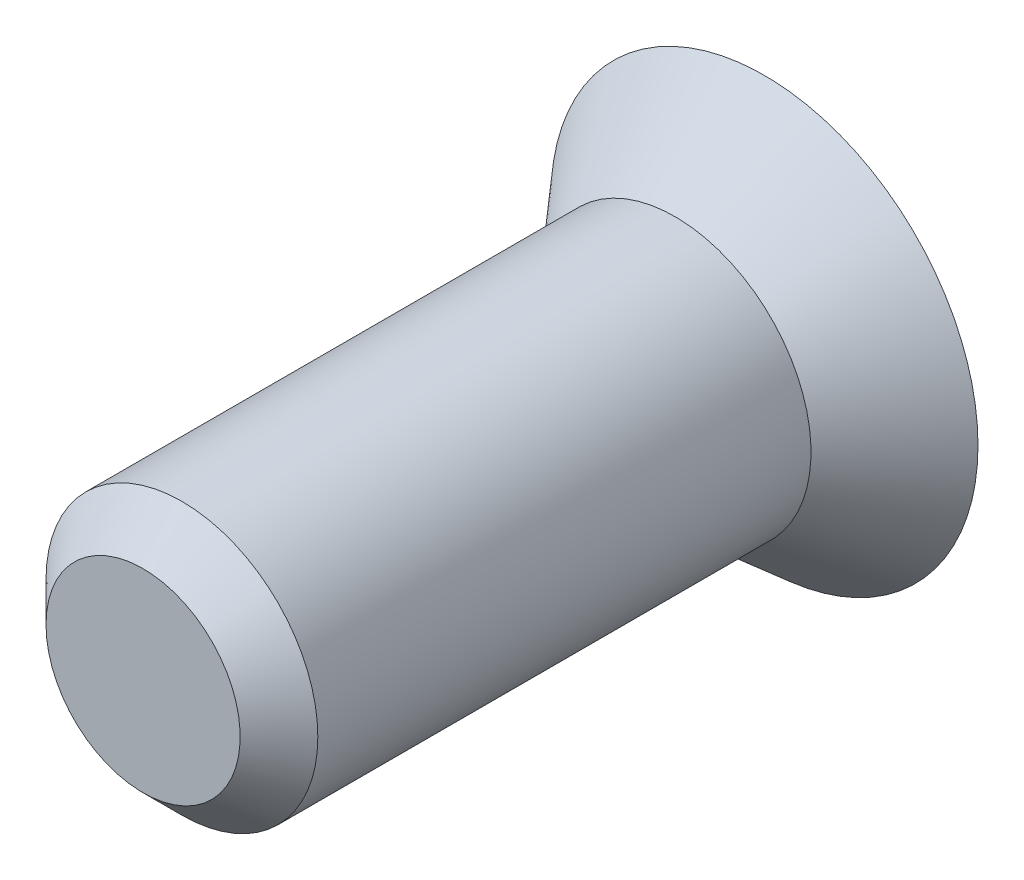
ISO-10303-21;
HEADER;
FILE_DESCRIPTION(('STEP AP214'),'2;1');
FILE_NAME('part.step','',(''),(''),'','','');
FILE_SCHEMA(('AUTOMOTIVE_DESIGN { 1 0 10303 214 1 1 1 1 }'));
ENDSEC;
DATA;
#1=APPLICATION_CONTEXT('core data for automotive mechanical design processes');
#2=APPLICATION_PROTOCOL_DEFINITION('international standard','automotive_design',2000,#1);
#3=PRODUCT_CONTEXT('',#1,'mechanical');
#4=PRODUCT('Part','Part','',(#3));
#5=PRODUCT_RELATED_PRODUCT_CATEGORY('part','',(#4));
#6=PRODUCT_DEFINITION_FORMATION('','',#4);
#7=PRODUCT_DEFINITION_CONTEXT('part definition',#1,'design');
#8=PRODUCT_DEFINITION('design','',#6,#7);
#9=PRODUCT_DEFINITION_SHAPE('','',#8);
#10=(LENGTH_UNIT() NAMED_UNIT(*) SI_UNIT(.MILLI.,.METRE.));
#11=(NAMED_UNIT(*) PLANE_ANGLE_UNIT() SI_UNIT($,.RADIAN.));
#12=(NAMED_UNIT(*) SI_UNIT($,.STERADIAN.) SOLID_ANGLE_UNIT());
#13=UNCERTAINTY_MEASURE_WITH_UNIT(LENGTH_MEASURE(1.E-05),#10,'distance_accuracy_value','');
#14=(GEOMETRIC_REPRESENTATION_CONTEXT(3) GLOBAL_UNCERTAINTY_ASSIGNED_CONTEXT((#13)) GLOBAL_UNIT_ASSIGNED_CONTEXT((#10,
#11,#12)) REPRESENTATION_CONTEXT('',''));
#15=CARTESIAN_POINT('',(0.,0.,0.));
#16=DIRECTION('',(0.,0.,1.));
#17=DIRECTION('',(1.,0.,0.));
#18=AXIS2_PLACEMENT_3D('',#15,#16,#17);
#19=CARTESIAN_POINT('',(0.5,1.4142135623731,0.));
#20=DIRECTION('',(-1.,0.,0.));
#21=DIRECTION('',(0.,0.,1.));
#22=AXIS2_PLACEMENT_3D('',#19,#20,#21);
#23=PLANE('',#22);
#24=DIRECTION('',(0.,1.,0.));
#25=VECTOR('',#24,1.);
#26=CARTESIAN_POINT('',(0.5,1.4142135623731,0.));
#27=LINE('',#26,#25);
#28=CARTESIAN_POINT('',(0.5,1.41421356237309,0.));
#29=VERTEX_POINT('',#28);
#30=CARTESIAN_POINT('',(0.5,0.5,0.));
#31=VERTEX_POINT('',#30);
#32=EDGE_CURVE('E122',#29,#31,#27,.F.);
#33=ORIENTED_EDGE('',*,*,#32,.T.);
#34=DIRECTION('',(0.,0.,-1.));
#35=VECTOR('',#34,1.);
#36=CARTESIAN_POINT('',(0.5,0.5,0.));
#37=LINE('',#36,#35);
#38=CARTESIAN_POINT('',(0.5,0.5,2.));
#39=VERTEX_POINT('',#38);
#40=EDGE_CURVE('E120',#39,#31,#37,.T.);
#41=ORIENTED_EDGE('',*,*,#40,.F.);
#42=DIRECTION('',(0.,1.,0.));
#43=VECTOR('',#42,1.);
#44=CARTESIAN_POINT('',(0.5,1.4142135623731,2.));
#45=LINE('',#44,#43);
#46=CARTESIAN_POINT('',(0.5,0.588282177300963,2.));
#47=VERTEX_POINT('',#46);
#48=EDGE_CURVE('E105',#39,#47,#45,.T.);
#49=ORIENTED_EDGE('',*,*,#48,.T.);
#50=CARTESIAN_POINT('',(0.5,1.4142135623731,0.));
#51=CARTESIAN_POINT('',(0.5,1.38173651147262,0.0841246527398535));
#52=CARTESIAN_POINT('',(0.5,1.34915372707467,0.168208262286797));
#53=CARTESIAN_POINT('',(0.5,1.28371911898866,0.336272265050712));
#54=CARTESIAN_POINT('',(0.5,1.25086729095149,0.420252656573818));
#55=CARTESIAN_POINT('',(0.5,1.15184163742013,0.671957023412562));
#56=CARTESIAN_POINT('',(0.5,1.08517982551906,0.839490529299564));
#57=CARTESIAN_POINT('',(0.5,0.983521215694453,1.09014308891406));
#58=CARTESIAN_POINT('',(0.5,0.949352504641873,1.17359753270166));
#59=CARTESIAN_POINT('',(0.5,0.880254941373845,1.34018723451986));
#60=CARTESIAN_POINT('',(0.5,0.84532612460817,1.42332250722411));
#61=CARTESIAN_POINT('',(0.5,0.774391046485071,1.58916274139833));
#62=CARTESIAN_POINT('',(0.5,0.738384485283732,1.67186757545855));
#63=CARTESIAN_POINT('',(0.5,0.683172895187782,1.79539646051367));
#64=CARTESIAN_POINT('',(0.5,0.664567254479669,1.83648785318932));
#65=CARTESIAN_POINT('',(0.5,0.626840141696684,1.91843556291664));
#66=CARTESIAN_POINT('',(0.5,0.607718641620394,1.95929186706079));
#67=CARTESIAN_POINT('',(0.5,0.588282177300966,2.));
#68=B_SPLINE_CURVE_WITH_KNOTS('',3,(#50,#51,#52,#53,#54,#55,#56,#57,#58,#59,#60,#61,#62,#63,#64,
#65,#66,#67),.UNSPECIFIED.,.F.,.F.,(4,2,2,2,2,2,2,2,4),(0.,0.270527492992427,0.541059367745703,
1.08197418243172,1.35250671273554,1.62302665288234,1.89362256821482,2.02894146587459,
2.16426772363221),.UNSPECIFIED.);
#69=EDGE_CURVE('E117',#29,#47,#68,.T.);
#70=ORIENTED_EDGE('',*,*,#69,.F.);
#71=EDGE_LOOP('',(#33,#41,#49,#70));
#72=FACE_BOUND('',#71,.T.);
#73=ADVANCED_FACE('F16',(#72),#23,.T.);
#74=CARTESIAN_POINT('',(0.5,0.5,0.));
#75=DIRECTION('',(0.,-1.,0.));
#76=DIRECTION('',(0.,0.,-1.));
#77=AXIS2_PLACEMENT_3D('',#74,#75,#76);
#78=PLANE('',#77);
#79=DIRECTION('',(1.,0.,0.));
#80=VECTOR('',#79,1.);
#81=CARTESIAN_POINT('',(0.5,0.5,0.));
#82=LINE('',#81,#80);
#83=CARTESIAN_POINT('',(1.41421356237309,0.5,0.));
#84=VERTEX_POINT('',#83);
#85=EDGE_CURVE('E114',#31,#84,#82,.T.);
#86=ORIENTED_EDGE('',*,*,#85,.T.);
#87=CARTESIAN_POINT('',(0.588282177300963,0.5,2.));
#88=CARTESIAN_POINT('',(0.608963125661999,0.5,1.95668191406995));
#89=CARTESIAN_POINT('',(0.629289229462512,0.5,1.91319712779127));
#90=CARTESIAN_POINT('',(0.669365637588879,0.5,1.82596587325405));
#91=CARTESIAN_POINT('',(0.689115976963892,0.5,1.78221942112039));
#92=CARTESIAN_POINT('',(0.747701433347295,0.5,1.65070160683659));
#93=CARTESIAN_POINT('',(0.785877710299729,0.5,1.56263747568219));
#94=CARTESIAN_POINT('',(0.861067644736216,0.5,1.38604743463291));
#95=CARTESIAN_POINT('',(0.898081631480329,0.5,1.29752166395327));
#96=CARTESIAN_POINT('',(0.971301855936888,0.5,1.12013235267332));
#97=CARTESIAN_POINT('',(1.00750805429975,0.5,1.03126879586423));
#98=CARTESIAN_POINT('',(1.10658325140762,0.5,0.785802316088087));
#99=CARTESIAN_POINT('',(1.16884190111913,0.5,0.628953405404117));
#100=CARTESIAN_POINT('',(1.26140349943159,0.5,0.393335437202652));
#101=CARTESIAN_POINT('',(1.29212331653999,0.5,0.3147291139713));
#102=CARTESIAN_POINT('',(1.35333084378555,0.5,0.157427167639811));
#103=CARTESIAN_POINT('',(1.38381855658726,0.5,0.0787315455767766));
#104=CARTESIAN_POINT('',(1.41421356237327,0.5,0.));
#105=B_SPLINE_CURVE_WITH_KNOTS('',3,(#87,#88,#89,#90,#91,#92,#93,#94,#95,#96,#97,#98,#99,#100,
#101,#102,#103,#104),.UNSPECIFIED.,.F.,.F.,(4,2,2,2,2,2,2,2,4),(0.,0.14399975674859,
0.287990729254777,0.575925251891938,0.863777457169457,1.1516436540338,1.65789558550701,
1.9110830523434,2.16426760819416),.UNSPECIFIED.);
#106=CARTESIAN_POINT('',(0.588282177300963,0.5,2.));
#107=VERTEX_POINT('',#106);
#108=EDGE_CURVE('E128',#107,#84,#105,.T.);
#109=ORIENTED_EDGE('',*,*,#108,.F.);
#110=DIRECTION('',(1.,0.,0.));
#111=VECTOR('',#110,1.);
#112=CARTESIAN_POINT('',(0.5,0.5,2.));
#113=LINE('',#112,#111);
#114=EDGE_CURVE('E330',#107,#39,#113,.F.);
#115=ORIENTED_EDGE('',*,*,#114,.T.);
#116=ORIENTED_EDGE('',*,*,#40,.T.);
#117=EDGE_LOOP('',(#86,#109,#115,#116));
#118=FACE_BOUND('',#117,.T.);
#119=ADVANCED_FACE('F339',(#118),#78,.T.);
#120=CARTESIAN_POINT('',(0.,0.,8.));
#121=DIRECTION('',(0.,0.,1.));
#122=DIRECTION('',(1.,0.,0.));
#123=AXIS2_PLACEMENT_3D('',#120,#121,#122);
#124=PLANE('',#123);
#125=CARTESIAN_POINT('',(0.,0.,8.00000000334936));
#126=DIRECTION('',(0.,0.,-1.));
#127=DIRECTION('',(-1.,0.,0.));
#128=AXIS2_PLACEMENT_3D('',#125,#126,#127);
#129=CIRCLE('',#128,1.25000000334936);
#130=CARTESIAN_POINT('',(-1.25000000334936,0.,8.00000000334936));
#131=VERTEX_POINT('',#130);
#132=EDGE_CURVE('E160',#131,#131,#129,.T.);
#133=ORIENTED_EDGE('',*,*,#132,.F.);
#134=EDGE_LOOP('',(#133));
#135=FACE_BOUND('',#134,.T.);
#136=ADVANCED_FACE('F140',(#135),#124,.T.);
#137=CARTESIAN_POINT('',(0.,0.,2.));
#138=DIRECTION('',(0.,0.,-1.));
#139=DIRECTION('',(-1.,0.,0.));
#140=AXIS2_PLACEMENT_3D('',#137,#138,#139);
#141=CONICAL_SURFACE('',#140,0.772059531467595,0.349065850398866);
#142=CARTESIAN_POINT('',(0.,0.,0.));
#143=DIRECTION('',(0.,0.,-1.));
#144=DIRECTION('',(-1.,0.,0.));
#145=AXIS2_PLACEMENT_3D('',#142,#143,#144);
#146=CIRCLE('',#145,1.5);
#147=CARTESIAN_POINT('',(-0.5,1.4142135623731,0.));
#148=VERTEX_POINT('',#147);
#149=EDGE_CURVE('E113',#148,#29,#146,.T.);
#150=ORIENTED_EDGE('',*,*,#149,.T.);
#151=ORIENTED_EDGE('',*,*,#69,.T.);
#152=CARTESIAN_POINT('',(0.,0.,2.));
#153=DIRECTION('',(0.,0.,-1.));
#154=DIRECTION('',(-1.,0.,0.));
#155=AXIS2_PLACEMENT_3D('',#152,#153,#154);
#156=CIRCLE('',#155,0.772059531467595);
#157=CARTESIAN_POINT('',(-0.5,0.588282177300963,2.));
#158=VERTEX_POINT('',#157);
#159=EDGE_CURVE('E20',#47,#158,#156,.F.);
#160=ORIENTED_EDGE('',*,*,#159,.T.);
#161=CARTESIAN_POINT('',(-0.5,1.4142135623731,0.));
#162=CARTESIAN_POINT('',(-0.5,1.38173651147262,0.0841246527398535));
#163=CARTESIAN_POINT('',(-0.5,1.34915372707467,0.168208262286797));
#164=CARTESIAN_POINT('',(-0.5,1.28371911898866,0.336272265050712));
#165=CARTESIAN_POINT('',(-0.5,1.25086729095149,0.420252656573818));
#166=CARTESIAN_POINT('',(-0.5,1.15184163742013,0.671957023412562));
#167=CARTESIAN_POINT('',(-0.5,1.08517982551906,0.839490529299564));
#168=CARTESIAN_POINT('',(-0.5,0.983521215694454,1.09014308891406));
#169=CARTESIAN_POINT('',(-0.5,0.949352504641874,1.17359753270166));
#170=CARTESIAN_POINT('',(-0.5,0.880254941373845,1.34018723451986));
#171=CARTESIAN_POINT('',(-0.5,0.84532612460817,1.42332250722411));
#172=CARTESIAN_POINT('',(-0.5,0.774391046485071,1.58916274139833));
#173=CARTESIAN_POINT('',(-0.5,0.738384485283732,1.67186757545855));
#174=CARTESIAN_POINT('',(-0.5,0.683172895187782,1.79539646051367));
#175=CARTESIAN_POINT('',(-0.5,0.664567254479669,1.83648785318932));
#176=CARTESIAN_POINT('',(-0.5,0.626840141696684,1.91843556291663));
#177=CARTESIAN_POINT('',(-0.5,0.607718641620394,1.95929186706079));
#178=CARTESIAN_POINT('',(-0.5,0.588282177300966,2.));
#179=B_SPLINE_CURVE_WITH_KNOTS('',3,(#161,#162,#163,#164,#165,#166,#167,#168,#169,#170,#171,
#172,#173,#174,#175,#176,#177,#178),.UNSPECIFIED.,.F.,.F.,(4,2,2,2,2,2,2,2,4),(0.,
0.270527492992427,0.541059367745703,1.08197418243172,1.35250671273554,1.62302665288234,
1.89362256821482,2.02894146587459,2.16426772363221),.UNSPECIFIED.);
#180=EDGE_CURVE('E145',#148,#158,#179,.T.);
#181=ORIENTED_EDGE('',*,*,#180,.F.);
#182=EDGE_LOOP('',(#150,#151,#160,#181));
#183=FACE_BOUND('',#182,.T.);
#184=ADVANCED_FACE('F124',(#183),#141,.F.);
#185=CARTESIAN_POINT('',(0.,0.,2.));
#186=DIRECTION('',(0.,0.,-1.));
#187=DIRECTION('',(-1.,0.,0.));
#188=AXIS2_PLACEMENT_3D('',#185,#186,#187);
#189=CONICAL_SURFACE('',#188,0.772059531467595,0.349065850398866);
#190=CARTESIAN_POINT('',(0.,0.,0.));
#191=DIRECTION('',(0.,0.,-1.));
#192=DIRECTION('',(-1.,0.,0.));
#193=AXIS2_PLACEMENT_3D('',#190,#191,#192);
#194=CIRCLE('',#193,1.5);
#195=CARTESIAN_POINT('',(1.41421356237309,-0.5,0.));
#196=VERTEX_POINT('',#195);
#197=EDGE_CURVE('E347',#84,#196,#194,.T.);
#198=ORIENTED_EDGE('',*,*,#197,.T.);
#199=CARTESIAN_POINT('',(0.588282177300963,-0.5,2.));
#200=CARTESIAN_POINT('',(0.608963125661999,-0.5,1.95668191406995));
#201=CARTESIAN_POINT('',(0.629289229462512,-0.5,1.91319712779127));
#202=CARTESIAN_POINT('',(0.669365637588879,-0.5,1.82596587325405));
#203=CARTESIAN_POINT('',(0.689115976963892,-0.5,1.78221942112039));
#204=CARTESIAN_POINT('',(0.747701433347295,-0.5,1.65070160683659));
#205=CARTESIAN_POINT('',(0.785877710299729,-0.5,1.56263747568219));
#206=CARTESIAN_POINT('',(0.861067644736216,-0.5,1.38604743463291));
#207=CARTESIAN_POINT('',(0.898081631480329,-0.5,1.29752166395327));
#208=CARTESIAN_POINT('',(0.971301855936888,-0.5,1.12013235267332));
#209=CARTESIAN_POINT('',(1.00750805429975,-0.5,1.03126879586423));
#210=CARTESIAN_POINT('',(1.10658325140762,-0.5,0.785802316088087));
#211=CARTESIAN_POINT('',(1.16884190111913,-0.5,0.628953405404117));
#212=CARTESIAN_POINT('',(1.26140349943159,-0.5,0.393335437202652));
#213=CARTESIAN_POINT('',(1.29212331653999,-0.5,0.3147291139713));
#214=CARTESIAN_POINT('',(1.35333084378555,-0.5,0.157427167639811));
#215=CARTESIAN_POINT('',(1.38381855658726,-0.5,0.0787315455767766));
#216=CARTESIAN_POINT('',(1.41421356237327,-0.5,0.));
#217=B_SPLINE_CURVE_WITH_KNOTS('',3,(#199,#200,#201,#202,#203,#204,#205,#206,#207,#208,#209,
#210,#211,#212,#213,#214,#215,#216),.UNSPECIFIED.,.F.,.F.,(4,2,2,2,2,2,2,2,4),(0.,
0.14399975674859,0.287990729254778,0.575925251891938,0.863777457169457,1.1516436540338,
1.65789558550701,1.9110830523434,2.16426760819416),.UNSPECIFIED.);
#218=CARTESIAN_POINT('',(0.588282177300963,-0.5,2.));
#219=VERTEX_POINT('',#218);
#220=EDGE_CURVE('E154',#219,#196,#217,.T.);
#221=ORIENTED_EDGE('',*,*,#220,.F.);
#222=CARTESIAN_POINT('',(0.,0.,2.));
#223=DIRECTION('',(0.,0.,-1.));
#224=DIRECTION('',(-1.,0.,0.));
#225=AXIS2_PLACEMENT_3D('',#222,#223,#224);
#226=CIRCLE('',#225,0.772059531467595);
#227=EDGE_CURVE('E125',#219,#107,#226,.F.);
#228=ORIENTED_EDGE('',*,*,#227,.T.);
#229=ORIENTED_EDGE('',*,*,#108,.T.);
#230=EDGE_LOOP('',(#198,#221,#228,#229));
#231=FACE_BOUND('',#230,.T.);
#232=ADVANCED_FACE('F139',(#231),#189,.F.);
#233=CARTESIAN_POINT('',(0.,0.,8.00000000334936));
#234=DIRECTION('',(0.,0.,-1.));
#235=DIRECTION('',(-1.,0.,0.));
#236=AXIS2_PLACEMENT_3D('',#233,#234,#235);
#237=CONICAL_SURFACE('',#236,1.25000000334936,0.78539815);
#238=CARTESIAN_POINT('',(0.,0.,7.5));
#239=DIRECTION('',(0.,0.,1.));
#240=DIRECTION('',(1.,0.,0.));
#241=AXIS2_PLACEMENT_3D('',#238,#239,#240);
#242=CIRCLE('',#241,1.75);
#243=CARTESIAN_POINT('',(1.75,0.,7.5));
#244=VERTEX_POINT('',#243);
#245=EDGE_CURVE('E301',#244,#244,#242,.F.);
#246=ORIENTED_EDGE('',*,*,#245,.F.);
#247=EDGE_LOOP('',(#246));
#248=FACE_BOUND('',#247,.T.);
#249=ORIENTED_EDGE('',*,*,#132,.T.);
#250=EDGE_LOOP('',(#249));
#251=FACE_BOUND('',#250,.T.);
#252=ADVANCED_FACE('F166',(#248,#251),#237,.T.);
#253=CARTESIAN_POINT('',(-0.5,0.5,0.));
#254=DIRECTION('',(1.,0.,0.));
#255=DIRECTION('',(0.,0.,-1.));
#256=AXIS2_PLACEMENT_3D('',#253,#254,#255);
#257=PLANE('',#256);
#258=DIRECTION('',(0.,1.,0.));
#259=VECTOR('',#258,1.);
#260=CARTESIAN_POINT('',(-0.5,0.5,0.));
#261=LINE('',#260,#259);
#262=CARTESIAN_POINT('',(-0.5,0.5,0.));
#263=VERTEX_POINT('',#262);
#264=EDGE_CURVE('E153',#263,#148,#261,.T.);
#265=ORIENTED_EDGE('',*,*,#264,.T.);
#266=ORIENTED_EDGE('',*,*,#180,.T.);
#267=DIRECTION('',(0.,1.,0.));
#268=VECTOR('',#267,1.);
#269=CARTESIAN_POINT('',(-0.5,0.5,2.));
#270=LINE('',#269,#268);
#271=CARTESIAN_POINT('',(-0.5,0.5,2.));
#272=VERTEX_POINT('',#271);
#273=EDGE_CURVE('E108',#158,#272,#270,.F.);
#274=ORIENTED_EDGE('',*,*,#273,.T.);
#275=DIRECTION('',(0.,0.,-1.));
#276=VECTOR('',#275,1.);
#277=CARTESIAN_POINT('',(-0.5,0.5,0.));
#278=LINE('',#277,#276);
#279=EDGE_CURVE('E291',#263,#272,#278,.F.);
#280=ORIENTED_EDGE('',*,*,#279,.F.);
#281=EDGE_LOOP('',(#265,#266,#274,#280));
#282=FACE_BOUND('',#281,.T.);
#283=ADVANCED_FACE('F162',(#282),#257,.T.);
#284=CARTESIAN_POINT('',(1.4142135623731,-0.5,0.));
#285=DIRECTION('',(0.,1.,0.));
#286=DIRECTION('',(0.,0.,1.));
#287=AXIS2_PLACEMENT_3D('',#284,#285,#286);
#288=PLANE('',#287);
#289=DIRECTION('',(1.,0.,0.));
#290=VECTOR('',#289,1.);
#291=CARTESIAN_POINT('',(1.4142135623731,-0.5,0.));
#292=LINE('',#291,#290);
#293=CARTESIAN_POINT('',(0.5,-0.5,0.));
#294=VERTEX_POINT('',#293);
#295=EDGE_CURVE('E306',#196,#294,#292,.F.);
#296=ORIENTED_EDGE('',*,*,#295,.T.);
#297=DIRECTION('',(0.,0.,1.));
#298=VECTOR('',#297,1.);
#299=CARTESIAN_POINT('',(0.5,-0.5,0.));
#300=LINE('',#299,#298);
#301=CARTESIAN_POINT('',(0.5,-0.5,2.));
#302=VERTEX_POINT('',#301);
#303=EDGE_CURVE('E279',#302,#294,#300,.F.);
#304=ORIENTED_EDGE('',*,*,#303,.F.);
#305=DIRECTION('',(1.,0.,0.));
#306=VECTOR('',#305,1.);
#307=CARTESIAN_POINT('',(1.4142135623731,-0.5,2.));
#308=LINE('',#307,#306);
#309=EDGE_CURVE('E152',#302,#219,#308,.T.);
#310=ORIENTED_EDGE('',*,*,#309,.T.);
#311=ORIENTED_EDGE('',*,*,#220,.T.);
#312=EDGE_LOOP('',(#296,#304,#310,#311));
#313=FACE_BOUND('',#312,.T.);
#314=ADVANCED_FACE('F165',(#313),#288,.T.);
#315=CARTESIAN_POINT('',(0.,0.,1.15036840722101));
#316=DIRECTION('',(0.,0.,1.));
#317=DIRECTION('',(1.,0.,0.));
#318=AXIS2_PLACEMENT_3D('',#315,#316,#317);
#319=CYLINDRICAL_SURFACE('',#318,1.75);
#320=ORIENTED_EDGE('',*,*,#245,.T.);
#321=EDGE_LOOP('',(#320));
#322=FACE_BOUND('',#321,.T.);
#323=CARTESIAN_POINT('',(0.,0.,1.15036841942757));
#324=DIRECTION('',(0.,0.,-1.));
#325=DIRECTION('',(-1.,0.,0.));
#326=AXIS2_PLACEMENT_3D('',#323,#324,#325);
#327=CIRCLE('',#326,1.75000001404205);
#328=CARTESIAN_POINT('',(-1.75000001404205,0.,1.15036841942757));
#329=VERTEX_POINT('',#328);
#330=EDGE_CURVE('E249',#329,#329,#327,.T.);
#331=ORIENTED_EDGE('',*,*,#330,.F.);
#332=EDGE_LOOP('',(#331));
#333=FACE_BOUND('',#332,.T.);
#334=ADVANCED_FACE('F241',(#322,#333),#319,.T.);
#335=CARTESIAN_POINT('',(-1.4142135623731,0.5,0.));
#336=DIRECTION('',(0.,-1.,0.));
#337=DIRECTION('',(0.,0.,-1.));
#338=AXIS2_PLACEMENT_3D('',#335,#336,#337);
#339=PLANE('',#338);
#340=DIRECTION('',(1.,0.,0.));
#341=VECTOR('',#340,1.);
#342=CARTESIAN_POINT('',(-1.4142135623731,0.5,0.));
#343=LINE('',#342,#341);
#344=CARTESIAN_POINT('',(-1.41421356237309,0.5,0.));
#345=VERTEX_POINT('',#344);
#346=EDGE_CURVE('E294',#345,#263,#343,.T.);
#347=ORIENTED_EDGE('',*,*,#346,.T.);
#348=ORIENTED_EDGE('',*,*,#279,.T.);
#349=DIRECTION('',(1.,0.,0.));
#350=VECTOR('',#349,1.);
#351=CARTESIAN_POINT('',(-1.4142135623731,0.5,2.));
#352=LINE('',#351,#350);
#353=CARTESIAN_POINT('',(-0.588282177300963,0.5,2.));
#354=VERTEX_POINT('',#353);
#355=EDGE_CURVE('E297',#272,#354,#352,.F.);
#356=ORIENTED_EDGE('',*,*,#355,.T.);
#357=CARTESIAN_POINT('',(-1.4142135623731,0.5,0.));
#358=CARTESIAN_POINT('',(-1.38173651147262,0.5,0.0841246527398535));
#359=CARTESIAN_POINT('',(-1.34915372707467,0.5,0.168208262286797));
#360=CARTESIAN_POINT('',(-1.28371911898866,0.5,0.336272265050712));
#361=CARTESIAN_POINT('',(-1.25086729095149,0.5,0.420252656573818));
#362=CARTESIAN_POINT('',(-1.15184163742013,0.5,0.671957023412562));
#363=CARTESIAN_POINT('',(-1.08517982551906,0.5,0.839490529299564));
#364=CARTESIAN_POINT('',(-0.983521215694454,0.5,1.09014308891406));
#365=CARTESIAN_POINT('',(-0.949352504641874,0.5,1.17359753270166));
#366=CARTESIAN_POINT('',(-0.880254941373845,0.5,1.34018723451986));
#367=CARTESIAN_POINT('',(-0.84532612460817,0.5,1.42332250722411));
#368=CARTESIAN_POINT('',(-0.774391046485071,0.5,1.58916274139833));
#369=CARTESIAN_POINT('',(-0.738384485283732,0.5,1.67186757545855));
#370=CARTESIAN_POINT('',(-0.683172895187782,0.5,1.79539646051367));
#371=CARTESIAN_POINT('',(-0.664567254479669,0.5,1.83648785318932));
#372=CARTESIAN_POINT('',(-0.626840141696684,0.5,1.91843556291663));
#373=CARTESIAN_POINT('',(-0.607718641620394,0.5,1.95929186706079));
#374=CARTESIAN_POINT('',(-0.588282177300966,0.5,2.));
#375=B_SPLINE_CURVE_WITH_KNOTS('',3,(#357,#358,#359,#360,#361,#362,#363,#364,#365,#366,#367,
#368,#369,#370,#371,#372,#373,#374),.UNSPECIFIED.,.F.,.F.,(4,2,2,2,2,2,2,2,4),(0.,
0.270527492992427,0.541059367745703,1.08197418243172,1.35250671273554,1.62302665288234,
1.89362256821482,2.02894146587459,2.16426772363221),.UNSPECIFIED.);
#376=EDGE_CURVE('E243',#345,#354,#375,.T.);
#377=ORIENTED_EDGE('',*,*,#376,.F.);
#378=EDGE_LOOP('',(#347,#348,#356,#377));
#379=FACE_BOUND('',#378,.T.);
#380=ADVANCED_FACE('F237',(#379),#339,.T.);
#381=CARTESIAN_POINT('',(0.5,-0.5,0.));
#382=DIRECTION('',(-1.,0.,0.));
#383=DIRECTION('',(0.,0.,1.));
#384=AXIS2_PLACEMENT_3D('',#381,#382,#383);
#385=PLANE('',#384);
#386=DIRECTION('',(0.,1.,0.));
#387=VECTOR('',#386,1.);
#388=CARTESIAN_POINT('',(0.5,-0.5,0.));
#389=LINE('',#388,#387);
#390=CARTESIAN_POINT('',(0.5,-1.41421356237309,0.));
#391=VERTEX_POINT('',#390);
#392=EDGE_CURVE('E277',#294,#391,#389,.F.);
#393=ORIENTED_EDGE('',*,*,#392,.T.);
#394=CARTESIAN_POINT('',(0.5,-0.588282177300963,2.));
#395=CARTESIAN_POINT('',(0.5,-0.608963125661999,1.95668191406995));
#396=CARTESIAN_POINT('',(0.5,-0.629289229462512,1.91319712779127));
#397=CARTESIAN_POINT('',(0.5,-0.669365637588879,1.82596587325405));
#398=CARTESIAN_POINT('',(0.5,-0.689115976963892,1.78221942112039));
#399=CARTESIAN_POINT('',(0.5,-0.747701433347295,1.65070160683659));
#400=CARTESIAN_POINT('',(0.5,-0.785877710299729,1.56263747568219));
#401=CARTESIAN_POINT('',(0.5,-0.861067644736216,1.38604743463291));
#402=CARTESIAN_POINT('',(0.5,-0.898081631480329,1.29752166395327));
#403=CARTESIAN_POINT('',(0.5,-0.971301855936888,1.12013235267332));
#404=CARTESIAN_POINT('',(0.5,-1.00750805429975,1.03126879586423));
#405=CARTESIAN_POINT('',(0.5,-1.10658325140762,0.785802316088087));
#406=CARTESIAN_POINT('',(0.5,-1.16884190111913,0.628953405404117));
#407=CARTESIAN_POINT('',(0.5,-1.26140349943159,0.393335437202652));
#408=CARTESIAN_POINT('',(0.5,-1.29212331653999,0.3147291139713));
#409=CARTESIAN_POINT('',(0.5,-1.35333084378555,0.157427167639811));
#410=CARTESIAN_POINT('',(0.5,-1.38381855658726,0.0787315455767766));
#411=CARTESIAN_POINT('',(0.5,-1.41421356237327,0.));
#412=B_SPLINE_CURVE_WITH_KNOTS('',3,(#394,#395,#396,#397,#398,#399,#400,#401,#402,#403,#404,
#405,#406,#407,#408,#409,#410,#411),.UNSPECIFIED.,.F.,.F.,(4,2,2,2,2,2,2,2,4),(0.,
0.14399975674859,0.287990729254777,0.575925251891938,0.863777457169457,1.1516436540338,
1.65789558550701,1.9110830523434,2.16426760819416),.UNSPECIFIED.);
#413=CARTESIAN_POINT('',(0.5,-0.588282177300963,2.));
#414=VERTEX_POINT('',#413);
#415=EDGE_CURVE('E219',#414,#391,#412,.T.);
#416=ORIENTED_EDGE('',*,*,#415,.F.);
#417=DIRECTION('',(0.,1.,0.));
#418=VECTOR('',#417,1.);
#419=CARTESIAN_POINT('',(0.5,0.,2.));
#420=LINE('',#419,#418);
#421=EDGE_CURVE('E248',#302,#414,#420,.F.);
#422=ORIENTED_EDGE('',*,*,#421,.F.);
#423=ORIENTED_EDGE('',*,*,#303,.T.);
#424=EDGE_LOOP('',(#393,#416,#422,#423));
#425=FACE_BOUND('',#424,.T.);
#426=ADVANCED_FACE('F231',(#425),#385,.T.);
#427=CARTESIAN_POINT('',(0.,0.,1.15036841942757));
#428=DIRECTION('',(0.,0.,-1.));
#429=DIRECTION('',(-1.,0.,0.));
#430=AXIS2_PLACEMENT_3D('',#427,#428,#429);
#431=CONICAL_SURFACE('',#430,1.75000001404205,0.715584981111111);
#432=CARTESIAN_POINT('',(0.,0.,0.));
#433=DIRECTION('',(0.,0.,-1.));
#434=DIRECTION('',(-1.,0.,0.));
#435=AXIS2_PLACEMENT_3D('',#432,#433,#434);
#436=CIRCLE('',#435,2.75);
#437=CARTESIAN_POINT('',(-2.75,0.,0.));
#438=VERTEX_POINT('',#437);
#439=EDGE_CURVE('E227',#438,#438,#436,.T.);
#440=ORIENTED_EDGE('',*,*,#439,.F.);
#441=EDGE_LOOP('',(#440));
#442=FACE_BOUND('',#441,.T.);
#443=ORIENTED_EDGE('',*,*,#330,.T.);
#444=EDGE_LOOP('',(#443));
#445=FACE_BOUND('',#444,.T.);
#446=ADVANCED_FACE('F236',(#442,#445),#431,.T.);
#447=CARTESIAN_POINT('',(0.,0.,2.));
#448=DIRECTION('',(0.,0.,-1.));
#449=DIRECTION('',(-1.,0.,0.));
#450=AXIS2_PLACEMENT_3D('',#447,#448,#449);
#451=CONICAL_SURFACE('',#450,0.772059531467595,0.349065850398866);
#452=CARTESIAN_POINT('',(0.,0.,0.));
#453=DIRECTION('',(0.,0.,-1.));
#454=DIRECTION('',(-1.,0.,0.));
#455=AXIS2_PLACEMENT_3D('',#452,#453,#454);
#456=CIRCLE('',#455,1.5);
#457=CARTESIAN_POINT('',(-1.4142135623731,-0.5,0.));
#458=VERTEX_POINT('',#457);
#459=EDGE_CURVE('E263',#345,#458,#456,.F.);
#460=ORIENTED_EDGE('',*,*,#459,.F.);
#461=ORIENTED_EDGE('',*,*,#376,.T.);
#462=CARTESIAN_POINT('',(0.,0.,2.));
#463=DIRECTION('',(0.,0.,-1.));
#464=DIRECTION('',(-1.,0.,0.));
#465=AXIS2_PLACEMENT_3D('',#462,#463,#464);
#466=CIRCLE('',#465,0.772059531467595);
#467=CARTESIAN_POINT('',(-0.588282177300963,-0.5,2.));
#468=VERTEX_POINT('',#467);
#469=EDGE_CURVE('E250',#468,#354,#466,.T.);
#470=ORIENTED_EDGE('',*,*,#469,.F.);
#471=CARTESIAN_POINT('',(-1.4142135623731,-0.5,0.));
#472=CARTESIAN_POINT('',(-1.38173651147262,-0.5,0.0841246527398533));
#473=CARTESIAN_POINT('',(-1.34915372707467,-0.5,0.168208262286797));
#474=CARTESIAN_POINT('',(-1.28371911898866,-0.5,0.336272265050712));
#475=CARTESIAN_POINT('',(-1.25086729095149,-0.5,0.420252656573818));
#476=CARTESIAN_POINT('',(-1.15184163742013,-0.5,0.671957023412562));
#477=CARTESIAN_POINT('',(-1.08517982551906,-0.5,0.839490529299564));
#478=CARTESIAN_POINT('',(-0.983521215694453,-0.5,1.09014308891406));
#479=CARTESIAN_POINT('',(-0.949352504641873,-0.5,1.17359753270166));
#480=CARTESIAN_POINT('',(-0.880254941373845,-0.5,1.34018723451986));
#481=CARTESIAN_POINT('',(-0.84532612460817,-0.5,1.42332250722411));
#482=CARTESIAN_POINT('',(-0.774391046485071,-0.5,1.58916274139833));
#483=CARTESIAN_POINT('',(-0.738384485283732,-0.5,1.67186757545855));
#484=CARTESIAN_POINT('',(-0.683172895187782,-0.5,1.79539646051367));
#485=CARTESIAN_POINT('',(-0.664567254479669,-0.5,1.83648785318932));
#486=CARTESIAN_POINT('',(-0.626840141696684,-0.5,1.91843556291664));
#487=CARTESIAN_POINT('',(-0.607718641620394,-0.5,1.95929186706079));
#488=CARTESIAN_POINT('',(-0.588282177300966,-0.5,2.));
#489=B_SPLINE_CURVE_WITH_KNOTS('',3,(#471,#472,#473,#474,#475,#476,#477,#478,#479,#480,#481,
#482,#483,#484,#485,#486,#487,#488),.UNSPECIFIED.,.F.,.F.,(4,2,2,2,2,2,2,2,4),(0.,
0.270527492992427,0.541059367745703,1.08197418243172,1.35250671273554,1.62302665288234,
1.89362256821482,2.02894146587459,2.16426772363221),.UNSPECIFIED.);
#490=EDGE_CURVE('E206',#458,#468,#489,.T.);
#491=ORIENTED_EDGE('',*,*,#490,.F.);
#492=EDGE_LOOP('',(#460,#461,#470,#491));
#493=FACE_BOUND('',#492,.T.);
#494=ADVANCED_FACE('F251',(#493),#451,.F.);
#495=CARTESIAN_POINT('',(0.,0.,2.));
#496=DIRECTION('',(0.,0.,-1.));
#497=DIRECTION('',(-1.,0.,0.));
#498=AXIS2_PLACEMENT_3D('',#495,#496,#497);
#499=PLANE('',#498);
#500=ORIENTED_EDGE('',*,*,#159,.F.);
#501=ORIENTED_EDGE('',*,*,#48,.F.);
#502=ORIENTED_EDGE('',*,*,#114,.F.);
#503=ORIENTED_EDGE('',*,*,#227,.F.);
#504=ORIENTED_EDGE('',*,*,#309,.F.);
#505=ORIENTED_EDGE('',*,*,#421,.T.);
#506=CARTESIAN_POINT('',(0.,0.,2.));
#507=DIRECTION('',(0.,0.,-1.));
#508=DIRECTION('',(-1.,0.,0.));
#509=AXIS2_PLACEMENT_3D('',#506,#507,#508);
#510=CIRCLE('',#509,0.772059531467595);
#511=CARTESIAN_POINT('',(-0.5,-0.588282177300963,2.));
#512=VERTEX_POINT('',#511);
#513=EDGE_CURVE('E228',#512,#414,#510,.F.);
#514=ORIENTED_EDGE('',*,*,#513,.F.);
#515=DIRECTION('',(0.,1.,0.));
#516=VECTOR('',#515,1.);
#517=CARTESIAN_POINT('',(-0.5,-1.4142135623731,2.));
#518=LINE('',#517,#516);
#519=CARTESIAN_POINT('',(-0.5,-0.5,2.));
#520=VERTEX_POINT('',#519);
#521=EDGE_CURVE('E203',#520,#512,#518,.F.);
#522=ORIENTED_EDGE('',*,*,#521,.F.);
#523=DIRECTION('',(1.,0.,0.));
#524=VECTOR('',#523,1.);
#525=CARTESIAN_POINT('',(-0.5,-0.5,2.));
#526=LINE('',#525,#524);
#527=EDGE_CURVE('E269',#468,#520,#526,.T.);
#528=ORIENTED_EDGE('',*,*,#527,.F.);
#529=ORIENTED_EDGE('',*,*,#469,.T.);
#530=ORIENTED_EDGE('',*,*,#355,.F.);
#531=ORIENTED_EDGE('',*,*,#273,.F.);
#532=EDGE_LOOP('',(#500,#501,#502,#503,#504,#505,#514,#522,#528,#529,#530,#531));
#533=FACE_BOUND('',#532,.T.);
#534=ADVANCED_FACE('F104',(#533),#499,.T.);
#535=CARTESIAN_POINT('',(0.,0.,2.));
#536=DIRECTION('',(0.,0.,-1.));
#537=DIRECTION('',(-1.,0.,0.));
#538=AXIS2_PLACEMENT_3D('',#535,#536,#537);
#539=CONICAL_SURFACE('',#538,0.772059531467595,0.349065850398866);
#540=CARTESIAN_POINT('',(0.,0.,0.));
#541=DIRECTION('',(0.,0.,-1.));
#542=DIRECTION('',(-1.,0.,0.));
#543=AXIS2_PLACEMENT_3D('',#540,#541,#542);
#544=CIRCLE('',#543,1.5);
#545=CARTESIAN_POINT('',(-0.5,-1.41421356237309,0.));
#546=VERTEX_POINT('',#545);
#547=EDGE_CURVE('E267',#546,#391,#544,.F.);
#548=ORIENTED_EDGE('',*,*,#547,.F.);
#549=CARTESIAN_POINT('',(-0.5,-0.588282177300963,2.));
#550=CARTESIAN_POINT('',(-0.5,-0.608963125661999,1.95668191406995));
#551=CARTESIAN_POINT('',(-0.5,-0.629289229462512,1.91319712779127));
#552=CARTESIAN_POINT('',(-0.5,-0.669365637588879,1.82596587325405));
#553=CARTESIAN_POINT('',(-0.5,-0.689115976963892,1.78221942112039));
#554=CARTESIAN_POINT('',(-0.5,-0.747701433347295,1.65070160683659));
#555=CARTESIAN_POINT('',(-0.5,-0.785877710299729,1.56263747568219));
#556=CARTESIAN_POINT('',(-0.5,-0.861067644736216,1.38604743463291));
#557=CARTESIAN_POINT('',(-0.5,-0.898081631480329,1.29752166395327));
#558=CARTESIAN_POINT('',(-0.5,-0.971301855936888,1.12013235267332));
#559=CARTESIAN_POINT('',(-0.5,-1.00750805429975,1.03126879586423));
#560=CARTESIAN_POINT('',(-0.5,-1.10658325140762,0.785802316088087));
#561=CARTESIAN_POINT('',(-0.5,-1.16884190111913,0.628953405404117));
#562=CARTESIAN_POINT('',(-0.5,-1.26140349943159,0.393335437202652));
#563=CARTESIAN_POINT('',(-0.5,-1.29212331653999,0.3147291139713));
#564=CARTESIAN_POINT('',(-0.5,-1.35333084378555,0.157427167639811));
#565=CARTESIAN_POINT('',(-0.5,-1.38381855658726,0.0787315455767766));
#566=CARTESIAN_POINT('',(-0.5,-1.41421356237327,0.));
#567=B_SPLINE_CURVE_WITH_KNOTS('',3,(#549,#550,#551,#552,#553,#554,#555,#556,#557,#558,#559,
#560,#561,#562,#563,#564,#565,#566),.UNSPECIFIED.,.F.,.F.,(4,2,2,2,2,2,2,2,4),(0.,
0.14399975674859,0.287990729254777,0.575925251891938,0.863777457169457,1.1516436540338,
1.65789558550701,1.9110830523434,2.16426760819416),.UNSPECIFIED.);
#568=EDGE_CURVE('E195',#512,#546,#567,.T.);
#569=ORIENTED_EDGE('',*,*,#568,.F.);
#570=ORIENTED_EDGE('',*,*,#513,.T.);
#571=ORIENTED_EDGE('',*,*,#415,.T.);
#572=EDGE_LOOP('',(#548,#569,#570,#571));
#573=FACE_BOUND('',#572,.T.);
#574=ADVANCED_FACE('F212',(#573),#539,.F.);
#575=CARTESIAN_POINT('',(0.,0.,0.));
#576=DIRECTION('',(0.,0.,-1.));
#577=DIRECTION('',(-1.,0.,0.));
#578=AXIS2_PLACEMENT_3D('',#575,#576,#577);
#579=PLANE('',#578);
#580=ORIENTED_EDGE('',*,*,#295,.F.);
#581=ORIENTED_EDGE('',*,*,#197,.F.);
#582=ORIENTED_EDGE('',*,*,#85,.F.);
#583=ORIENTED_EDGE('',*,*,#32,.F.);
#584=ORIENTED_EDGE('',*,*,#149,.F.);
#585=ORIENTED_EDGE('',*,*,#264,.F.);
#586=ORIENTED_EDGE('',*,*,#346,.F.);
#587=ORIENTED_EDGE('',*,*,#459,.T.);
#588=DIRECTION('',(1.,0.,0.));
#589=VECTOR('',#588,1.);
#590=CARTESIAN_POINT('',(-0.5,-0.5,0.));
#591=LINE('',#590,#589);
#592=CARTESIAN_POINT('',(-0.5,-0.5,0.));
#593=VERTEX_POINT('',#592);
#594=EDGE_CURVE('E35',#593,#458,#591,.F.);
#595=ORIENTED_EDGE('',*,*,#594,.F.);
#596=DIRECTION('',(0.,1.,0.));
#597=VECTOR('',#596,1.);
#598=CARTESIAN_POINT('',(-0.5,-1.4142135623731,0.));
#599=LINE('',#598,#597);
#600=EDGE_CURVE('E26',#546,#593,#599,.T.);
#601=ORIENTED_EDGE('',*,*,#600,.F.);
#602=ORIENTED_EDGE('',*,*,#547,.T.);
#603=ORIENTED_EDGE('',*,*,#392,.F.);
#604=EDGE_LOOP('',(#580,#581,#582,#583,#584,#585,#586,#587,#595,#601,#602,#603));
#605=FACE_BOUND('',#604,.T.);
#606=ORIENTED_EDGE('',*,*,#439,.T.);
#607=EDGE_LOOP('',(#606));
#608=FACE_BOUND('',#607,.T.);
#609=ADVANCED_FACE('F187',(#605,#608),#579,.T.);
#610=CARTESIAN_POINT('',(-0.5,-0.5,0.));
#611=DIRECTION('',(0.,1.,0.));
#612=DIRECTION('',(0.,0.,1.));
#613=AXIS2_PLACEMENT_3D('',#610,#611,#612);
#614=PLANE('',#613);
#615=ORIENTED_EDGE('',*,*,#594,.T.);
#616=ORIENTED_EDGE('',*,*,#490,.T.);
#617=ORIENTED_EDGE('',*,*,#527,.T.);
#618=DIRECTION('',(0.,0.,-1.));
#619=VECTOR('',#618,1.);
#620=CARTESIAN_POINT('',(-0.5,-0.5,0.));
#621=LINE('',#620,#619);
#622=EDGE_CURVE('E11',#593,#520,#621,.F.);
#623=ORIENTED_EDGE('',*,*,#622,.F.);
#624=EDGE_LOOP('',(#615,#616,#617,#623));
#625=FACE_BOUND('',#624,.T.);
#626=ADVANCED_FACE('F181',(#625),#614,.T.);
#627=CARTESIAN_POINT('',(-0.5,-1.4142135623731,0.));
#628=DIRECTION('',(1.,0.,0.));
#629=DIRECTION('',(0.,0.,-1.));
#630=AXIS2_PLACEMENT_3D('',#627,#628,#629);
#631=PLANE('',#630);
#632=ORIENTED_EDGE('',*,*,#600,.T.);
#633=ORIENTED_EDGE('',*,*,#622,.T.);
#634=ORIENTED_EDGE('',*,*,#521,.T.);
#635=ORIENTED_EDGE('',*,*,#568,.T.);
#636=EDGE_LOOP('',(#632,#633,#634,#635));
#637=FACE_BOUND('',#636,.T.);
#638=ADVANCED_FACE('F179',(#637),#631,.T.);
#639=CLOSED_SHELL('',(#73,#119,#136,#184,#232,#252,#283,#314,#334,#380,#426,#446,#494,#534,#574,
#609,#626,#638));
#640=MANIFOLD_SOLID_BREP('B1',#639);
#641=ADVANCED_BREP_SHAPE_REPRESENTATION('',(#18,#640),#14);
#642=SHAPE_DEFINITION_REPRESENTATION(#9,#641);
ENDSEC;
END-ISO-10303-21;
